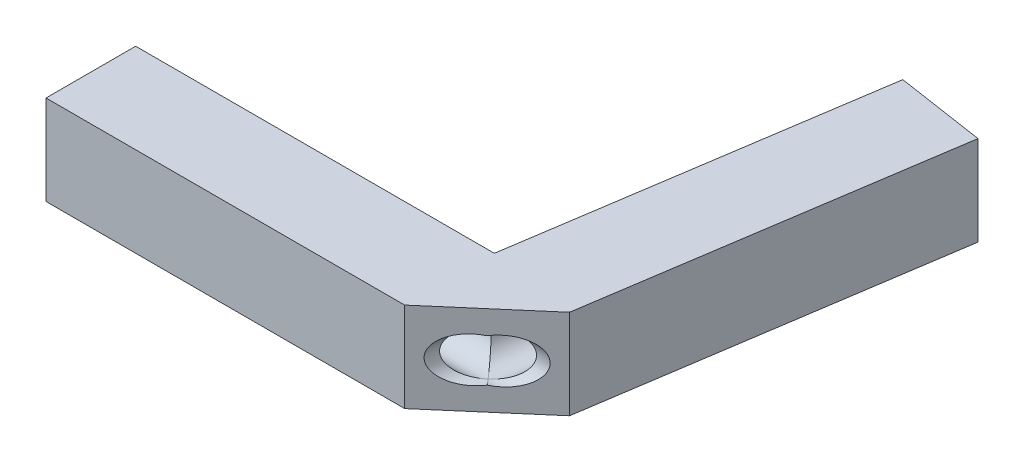
ISO-10303-21;
HEADER;
FILE_DESCRIPTION(('STEP AP214'),'2;1');
FILE_NAME('part.step','',(''),(''),'','','');
FILE_SCHEMA(('AUTOMOTIVE_DESIGN { 1 0 10303 214 1 1 1 1 }'));
ENDSEC;
DATA;
#1=APPLICATION_CONTEXT('core data for automotive mechanical design processes');
#2=APPLICATION_PROTOCOL_DEFINITION('international standard','automotive_design',2000,#1);
#3=PRODUCT_CONTEXT('',#1,'mechanical');
#4=PRODUCT('Part','Part','',(#3));
#5=PRODUCT_RELATED_PRODUCT_CATEGORY('part','',(#4));
#6=PRODUCT_DEFINITION_FORMATION('','',#4);
#7=PRODUCT_DEFINITION_CONTEXT('part definition',#1,'design');
#8=PRODUCT_DEFINITION('design','',#6,#7);
#9=PRODUCT_DEFINITION_SHAPE('','',#8);
#10=(LENGTH_UNIT() NAMED_UNIT(*) SI_UNIT(.MILLI.,.METRE.));
#11=(NAMED_UNIT(*) PLANE_ANGLE_UNIT() SI_UNIT($,.RADIAN.));
#12=(NAMED_UNIT(*) SI_UNIT($,.STERADIAN.) SOLID_ANGLE_UNIT());
#13=UNCERTAINTY_MEASURE_WITH_UNIT(LENGTH_MEASURE(1.E-05),#10,'distance_accuracy_value','');
#14=(GEOMETRIC_REPRESENTATION_CONTEXT(3) GLOBAL_UNCERTAINTY_ASSIGNED_CONTEXT((#13)) GLOBAL_UNIT_ASSIGNED_CONTEXT((#10,
#11,#12)) REPRESENTATION_CONTEXT('',''));
#15=CARTESIAN_POINT('',(0.,0.,0.));
#16=DIRECTION('',(0.,0.,1.));
#17=DIRECTION('',(1.,0.,0.));
#18=AXIS2_PLACEMENT_3D('',#15,#16,#17);
#19=CARTESIAN_POINT('',(4.,1.,1.));
#20=DIRECTION('',(-1.,0.,0.));
#21=DIRECTION('',(0.,0.,1.));
#22=AXIS2_PLACEMENT_3D('',#19,#20,#21);
#23=CYLINDRICAL_SURFACE('',#22,0.5);
#24=CARTESIAN_POINT('',(-8.,1.,1.));
#25=DIRECTION('',(-1.,0.,0.));
#26=DIRECTION('',(0.,0.,1.));
#27=AXIS2_PLACEMENT_3D('',#24,#25,#26);
#28=CIRCLE('',#27,0.5);
#29=CARTESIAN_POINT('',(-8.,1.,1.5));
#30=VERTEX_POINT('',#29);
#31=EDGE_CURVE('E189',#30,#30,#28,.T.);
#32=ORIENTED_EDGE('',*,*,#31,.T.);
#33=EDGE_LOOP('',(#32));
#34=FACE_BOUND('',#33,.T.);
#35=CARTESIAN_POINT('',(0.859680309765816,1.,1.));
#36=DIRECTION('',(-0.758305029177757,0.,0.651899902380512));
#37=DIRECTION('',(-0.651899902380512,0.,-0.758305029177757));
#38=AXIS2_PLACEMENT_3D('',#35,#36,#37);
#39=ELLIPSE('',#38,0.659365269596271,0.5);
#40=CARTESIAN_POINT('',(0.859680309765816,0.5,1.));
#41=VERTEX_POINT('',#40);
#42=CARTESIAN_POINT('',(0.859680309765816,1.5,1.));
#43=VERTEX_POINT('',#42);
#44=EDGE_CURVE('E55',#41,#43,#39,.F.);
#45=ORIENTED_EDGE('',*,*,#44,.T.);
#46=CARTESIAN_POINT('',(0.859680309765816,1.,1.));
#47=DIRECTION('',(-0.651899902380512,0.,-0.758305029177757));
#48=DIRECTION('',(-0.758305029177757,0.,0.651899902380512));
#49=AXIS2_PLACEMENT_3D('',#46,#47,#48);
#50=ELLIPSE('',#49,0.766988916817097,0.5);
#51=EDGE_CURVE('E11',#43,#41,#50,.F.);
#52=ORIENTED_EDGE('',*,*,#51,.T.);
#53=EDGE_LOOP('',(#45,#52));
#54=FACE_BOUND('',#53,.T.);
#55=ADVANCED_FACE('F41',(#34,#54),#23,.F.);
#56=CARTESIAN_POINT('',(1.97735589798252,2.,0.300106069105115));
#57=DIRECTION('',(0.988677948991262,0.,0.150053034552557));
#58=DIRECTION('',(0.150053034552557,0.,-0.988677948991262));
#59=AXIS2_PLACEMENT_3D('',#56,#57,#58);
#60=PLANE('',#59);
#61=DIRECTION('',(-0.150053034552557,0.,0.988677948991262));
#62=VECTOR('',#61,1.);
#63=CARTESIAN_POINT('',(1.97735589798252,0.,0.300106069105115));
#64=LINE('',#63,#62);
#65=CARTESIAN_POINT('',(3.17778017440298,0.,-7.60931752282498));
#66=VERTEX_POINT('',#65);
#67=CARTESIAN_POINT('',(1.97735589798252,0.,0.300106069105114));
#68=VERTEX_POINT('',#67);
#69=EDGE_CURVE('E147',#66,#68,#64,.T.);
#70=ORIENTED_EDGE('',*,*,#69,.F.);
#71=DIRECTION('',(0.,-1.,0.));
#72=VECTOR('',#71,1.);
#73=CARTESIAN_POINT('',(3.17778017440298,2.,-7.60931752282498));
#74=LINE('',#73,#72);
#75=CARTESIAN_POINT('',(3.17778017440298,2.,-7.60931752282498));
#76=VERTEX_POINT('',#75);
#77=EDGE_CURVE('E97',#76,#66,#74,.T.);
#78=ORIENTED_EDGE('',*,*,#77,.F.);
#79=DIRECTION('',(-0.150053034552557,0.,0.988677948991262));
#80=VECTOR('',#79,1.);
#81=CARTESIAN_POINT('',(1.97735589798252,2.,0.300106069105115));
#82=LINE('',#81,#80);
#83=CARTESIAN_POINT('',(1.97735589798252,2.,0.300106069105114));
#84=VERTEX_POINT('',#83);
#85=EDGE_CURVE('E171',#76,#84,#82,.T.);
#86=ORIENTED_EDGE('',*,*,#85,.T.);
#87=DIRECTION('',(0.,-1.,0.));
#88=VECTOR('',#87,1.);
#89=CARTESIAN_POINT('',(1.97735589798252,2.,0.300106069105114));
#90=LINE('',#89,#88);
#91=EDGE_CURVE('E64',#84,#68,#90,.T.);
#92=ORIENTED_EDGE('',*,*,#91,.T.);
#93=EDGE_LOOP('',(#70,#78,#86,#92));
#94=FACE_BOUND('',#93,.T.);
#95=ADVANCED_FACE('F43',(#94),#60,.T.);
#96=CARTESIAN_POINT('',(1.20042427642047,2.,-7.9094235919301));
#97=DIRECTION('',(0.150053034552558,0.,-0.988677948991262));
#98=DIRECTION('',(-0.988677948991262,0.,-0.150053034552558));
#99=AXIS2_PLACEMENT_3D('',#96,#97,#98);
#100=PLANE('',#99);
#101=CARTESIAN_POINT('',(2.18910222541173,1.,-7.75937055737754));
#102=DIRECTION('',(0.150053034552558,0.,-0.988677948991262));
#103=DIRECTION('',(-0.988677948991262,0.,-0.150053034552558));
#104=AXIS2_PLACEMENT_3D('',#101,#102,#103);
#105=CIRCLE('',#104,0.5);
#106=CARTESIAN_POINT('',(1.69476325091609,1.,-7.83439707465382));
#107=VERTEX_POINT('',#106);
#108=EDGE_CURVE('E215',#107,#107,#105,.T.);
#109=ORIENTED_EDGE('',*,*,#108,.F.);
#110=EDGE_LOOP('',(#109));
#111=FACE_BOUND('',#110,.T.);
#112=DIRECTION('',(0.988677948991262,0.,0.150053034552558));
#113=VECTOR('',#112,1.);
#114=CARTESIAN_POINT('',(1.20042427642047,0.,-7.9094235919301));
#115=LINE('',#114,#113);
#116=CARTESIAN_POINT('',(1.20042427642046,0.,-7.9094235919301));
#117=VERTEX_POINT('',#116);
#118=EDGE_CURVE('E150',#117,#66,#115,.T.);
#119=ORIENTED_EDGE('',*,*,#118,.F.);
#120=DIRECTION('',(0.,-1.,0.));
#121=VECTOR('',#120,1.);
#122=CARTESIAN_POINT('',(1.20042427642046,2.,-7.9094235919301));
#123=LINE('',#122,#121);
#124=CARTESIAN_POINT('',(1.20042427642046,2.,-7.9094235919301));
#125=VERTEX_POINT('',#124);
#126=EDGE_CURVE('E181',#125,#117,#123,.T.);
#127=ORIENTED_EDGE('',*,*,#126,.F.);
#128=DIRECTION('',(0.988677948991262,0.,0.150053034552558));
#129=VECTOR('',#128,1.);
#130=CARTESIAN_POINT('',(1.20042427642047,2.,-7.9094235919301));
#131=LINE('',#130,#129);
#132=EDGE_CURVE('E226',#125,#76,#131,.T.);
#133=ORIENTED_EDGE('',*,*,#132,.T.);
#134=ORIENTED_EDGE('',*,*,#77,.T.);
#135=EDGE_LOOP('',(#119,#127,#133,#134));
#136=FACE_BOUND('',#135,.T.);
#137=ADVANCED_FACE('F240',(#111,#136),#100,.T.);
#138=CARTESIAN_POINT('',(0.,2.,0.));
#139=DIRECTION('',(-0.988677948991262,0.,-0.150053034552557));
#140=DIRECTION('',(-0.150053034552557,0.,0.988677948991262));
#141=AXIS2_PLACEMENT_3D('',#138,#139,#140);
#142=PLANE('',#141);
#143=DIRECTION('',(0.150053034552557,0.,-0.988677948991262));
#144=VECTOR('',#143,1.);
#145=CARTESIAN_POINT('',(0.,0.,0.));
#146=LINE('',#145,#144);
#147=CARTESIAN_POINT('',(0.,0.,0.));
#148=VERTEX_POINT('',#147);
#149=EDGE_CURVE('E155',#148,#117,#146,.T.);
#150=ORIENTED_EDGE('',*,*,#149,.F.);
#151=DIRECTION('',(0.,-1.,0.));
#152=VECTOR('',#151,1.);
#153=CARTESIAN_POINT('',(0.,2.,0.));
#154=LINE('',#153,#152);
#155=CARTESIAN_POINT('',(0.,2.,0.));
#156=VERTEX_POINT('',#155);
#157=EDGE_CURVE('E178',#156,#148,#154,.T.);
#158=ORIENTED_EDGE('',*,*,#157,.F.);
#159=DIRECTION('',(0.150053034552557,0.,-0.988677948991262));
#160=VECTOR('',#159,1.);
#161=CARTESIAN_POINT('',(0.,2.,0.));
#162=LINE('',#161,#160);
#163=EDGE_CURVE('E230',#156,#125,#162,.T.);
#164=ORIENTED_EDGE('',*,*,#163,.T.);
#165=ORIENTED_EDGE('',*,*,#126,.T.);
#166=EDGE_LOOP('',(#150,#158,#164,#165));
#167=FACE_BOUND('',#166,.T.);
#168=ADVANCED_FACE('F236',(#167),#142,.T.);
#169=CARTESIAN_POINT('',(0.,2.,0.));
#170=DIRECTION('',(0.,0.,1.));
#171=DIRECTION('',(1.,0.,0.));
#172=AXIS2_PLACEMENT_3D('',#169,#170,#171);
#173=PLANE('',#172);
#174=DIRECTION('',(-1.,0.,0.));
#175=VECTOR('',#174,1.);
#176=CARTESIAN_POINT('',(0.,0.,0.));
#177=LINE('',#176,#175);
#178=CARTESIAN_POINT('',(-8.,0.,0.));
#179=VERTEX_POINT('',#178);
#180=EDGE_CURVE('E159',#148,#179,#177,.T.);
#181=ORIENTED_EDGE('',*,*,#180,.T.);
#182=DIRECTION('',(0.,-1.,0.));
#183=VECTOR('',#182,1.);
#184=CARTESIAN_POINT('',(-8.,2.,0.));
#185=LINE('',#184,#183);
#186=CARTESIAN_POINT('',(-8.,2.,0.));
#187=VERTEX_POINT('',#186);
#188=EDGE_CURVE('E136',#187,#179,#185,.T.);
#189=ORIENTED_EDGE('',*,*,#188,.F.);
#190=DIRECTION('',(-1.,0.,0.));
#191=VECTOR('',#190,1.);
#192=CARTESIAN_POINT('',(0.,2.,0.));
#193=LINE('',#192,#191);
#194=EDGE_CURVE('E121',#156,#187,#193,.T.);
#195=ORIENTED_EDGE('',*,*,#194,.F.);
#196=ORIENTED_EDGE('',*,*,#157,.T.);
#197=EDGE_LOOP('',(#181,#189,#195,#196));
#198=FACE_BOUND('',#197,.T.);
#199=ADVANCED_FACE('F245',(#198),#173,.F.);
#200=CARTESIAN_POINT('',(-8.,2.,0.));
#201=DIRECTION('',(1.,0.,0.));
#202=DIRECTION('',(0.,0.,-1.));
#203=AXIS2_PLACEMENT_3D('',#200,#201,#202);
#204=PLANE('',#203);
#205=ORIENTED_EDGE('',*,*,#31,.F.);
#206=EDGE_LOOP('',(#205));
#207=FACE_BOUND('',#206,.T.);
#208=DIRECTION('',(0.,0.,1.));
#209=VECTOR('',#208,1.);
#210=CARTESIAN_POINT('',(-8.,0.,0.));
#211=LINE('',#210,#209);
#212=CARTESIAN_POINT('',(-8.,0.,2.));
#213=VERTEX_POINT('',#212);
#214=EDGE_CURVE('E131',#179,#213,#211,.T.);
#215=ORIENTED_EDGE('',*,*,#214,.T.);
#216=DIRECTION('',(0.,-1.,0.));
#217=VECTOR('',#216,1.);
#218=CARTESIAN_POINT('',(-8.,2.,2.));
#219=LINE('',#218,#217);
#220=CARTESIAN_POINT('',(-8.,2.,2.));
#221=VERTEX_POINT('',#220);
#222=EDGE_CURVE('E128',#221,#213,#219,.T.);
#223=ORIENTED_EDGE('',*,*,#222,.F.);
#224=DIRECTION('',(0.,0.,1.));
#225=VECTOR('',#224,1.);
#226=CARTESIAN_POINT('',(-8.,2.,0.));
#227=LINE('',#226,#225);
#228=EDGE_CURVE('E113',#187,#221,#227,.T.);
#229=ORIENTED_EDGE('',*,*,#228,.F.);
#230=ORIENTED_EDGE('',*,*,#188,.T.);
#231=EDGE_LOOP('',(#215,#223,#229,#230));
#232=FACE_BOUND('',#231,.T.);
#233=ADVANCED_FACE('F129',(#207,#232),#204,.F.);
#234=CARTESIAN_POINT('',(0.,2.,2.));
#235=DIRECTION('',(0.,0.,1.));
#236=DIRECTION('',(1.,0.,0.));
#237=AXIS2_PLACEMENT_3D('',#234,#235,#236);
#238=PLANE('',#237);
#239=DIRECTION('',(-1.,0.,0.));
#240=VECTOR('',#239,1.);
#241=CARTESIAN_POINT('',(0.,0.,2.));
#242=LINE('',#241,#240);
#243=CARTESIAN_POINT('',(0.,0.,2.));
#244=VERTEX_POINT('',#243);
#245=EDGE_CURVE('E164',#244,#213,#242,.T.);
#246=ORIENTED_EDGE('',*,*,#245,.F.);
#247=DIRECTION('',(0.,-1.,0.));
#248=VECTOR('',#247,1.);
#249=CARTESIAN_POINT('',(0.,2.,2.));
#250=LINE('',#249,#248);
#251=CARTESIAN_POINT('',(0.,2.,2.));
#252=VERTEX_POINT('',#251);
#253=EDGE_CURVE('E137',#252,#244,#250,.T.);
#254=ORIENTED_EDGE('',*,*,#253,.F.);
#255=DIRECTION('',(-1.,0.,0.));
#256=VECTOR('',#255,1.);
#257=CARTESIAN_POINT('',(0.,2.,2.));
#258=LINE('',#257,#256);
#259=EDGE_CURVE('E118',#252,#221,#258,.T.);
#260=ORIENTED_EDGE('',*,*,#259,.T.);
#261=ORIENTED_EDGE('',*,*,#222,.T.);
#262=EDGE_LOOP('',(#246,#254,#260,#261));
#263=FACE_BOUND('',#262,.T.);
#264=ADVANCED_FACE('F139',(#263),#238,.T.);
#265=CARTESIAN_POINT('',(0.988677948991263,2.,1.15005303455256));
#266=DIRECTION('',(0.651899902380513,0.,0.758305029177757));
#267=DIRECTION('',(0.758305029177757,0.,-0.651899902380513));
#268=AXIS2_PLACEMENT_3D('',#265,#266,#267);
#269=PLANE('',#268);
#270=CARTESIAN_POINT('',(0.814132792090512,1.,1.30010606910512));
#271=DIRECTION('',(0.651899902380513,0.,0.758305029177757));
#272=DIRECTION('',(0.758305029177757,0.,-0.651899902380513));
#273=AXIS2_PLACEMENT_3D('',#270,#271,#272);
#274=ELLIPSE('',#273,0.766988916817098,0.5);
#275=CARTESIAN_POINT('',(0.98867794899126,1.4769529188731,1.15005303455256));
#276=VERTEX_POINT('',#275);
#277=CARTESIAN_POINT('',(0.98867794899126,0.523047081126901,1.15005303455256));
#278=VERTEX_POINT('',#277);
#279=EDGE_CURVE('E212',#276,#278,#274,.T.);
#280=ORIENTED_EDGE('',*,*,#279,.F.);
#281=CARTESIAN_POINT('',(1.16322310589201,1.,1.));
#282=DIRECTION('',(0.651899902380513,0.,0.758305029177757));
#283=DIRECTION('',(-0.758305029177757,0.,0.651899902380513));
#284=AXIS2_PLACEMENT_3D('',#281,#282,#283);
#285=ELLIPSE('',#284,0.766988916817096,0.5);
#286=EDGE_CURVE('E151',#278,#276,#285,.T.);
#287=ORIENTED_EDGE('',*,*,#286,.F.);
#288=EDGE_LOOP('',(#280,#287));
#289=FACE_BOUND('',#288,.T.);
#290=DIRECTION('',(-0.758305029177757,0.,0.651899902380512));
#291=VECTOR('',#290,1.);
#292=CARTESIAN_POINT('',(0.988677948991263,0.,1.15005303455256));
#293=LINE('',#292,#291);
#294=EDGE_CURVE('E167',#68,#244,#293,.T.);
#295=ORIENTED_EDGE('',*,*,#294,.F.);
#296=ORIENTED_EDGE('',*,*,#91,.F.);
#297=DIRECTION('',(-0.758305029177757,0.,0.651899902380512));
#298=VECTOR('',#297,1.);
#299=CARTESIAN_POINT('',(0.988677948991263,2.,1.15005303455256));
#300=LINE('',#299,#298);
#301=EDGE_CURVE('E141',#84,#252,#300,.T.);
#302=ORIENTED_EDGE('',*,*,#301,.T.);
#303=ORIENTED_EDGE('',*,*,#253,.T.);
#304=EDGE_LOOP('',(#295,#296,#302,#303));
#305=FACE_BOUND('',#304,.T.);
#306=ADVANCED_FACE('F211',(#289,#305),#269,.T.);
#307=CARTESIAN_POINT('',(0.,2.,0.));
#308=DIRECTION('',(0.,1.,0.));
#309=DIRECTION('',(0.,0.,1.));
#310=AXIS2_PLACEMENT_3D('',#307,#308,#309);
#311=PLANE('',#310);
#312=ORIENTED_EDGE('',*,*,#85,.F.);
#313=ORIENTED_EDGE('',*,*,#132,.F.);
#314=ORIENTED_EDGE('',*,*,#163,.F.);
#315=ORIENTED_EDGE('',*,*,#194,.T.);
#316=ORIENTED_EDGE('',*,*,#228,.T.);
#317=ORIENTED_EDGE('',*,*,#259,.F.);
#318=ORIENTED_EDGE('',*,*,#301,.F.);
#319=EDGE_LOOP('',(#312,#313,#314,#315,#316,#317,#318));
#320=FACE_BOUND('',#319,.T.);
#321=ADVANCED_FACE('F115',(#320),#311,.T.);
#322=CARTESIAN_POINT('',(0.,0.,0.));
#323=DIRECTION('',(0.,1.,0.));
#324=DIRECTION('',(0.,0.,1.));
#325=AXIS2_PLACEMENT_3D('',#322,#323,#324);
#326=PLANE('',#325);
#327=ORIENTED_EDGE('',*,*,#69,.T.);
#328=ORIENTED_EDGE('',*,*,#294,.T.);
#329=ORIENTED_EDGE('',*,*,#245,.T.);
#330=ORIENTED_EDGE('',*,*,#214,.F.);
#331=ORIENTED_EDGE('',*,*,#180,.F.);
#332=ORIENTED_EDGE('',*,*,#149,.T.);
#333=ORIENTED_EDGE('',*,*,#118,.T.);
#334=EDGE_LOOP('',(#327,#328,#329,#330,#331,#332,#333));
#335=FACE_BOUND('',#334,.T.);
#336=ADVANCED_FACE('F243',(#335),#326,.F.);
#337=CARTESIAN_POINT('',(0.859680309765816,1.,1.));
#338=DIRECTION('',(-0.758305029177757,0.,0.651899902380512));
#339=DIRECTION('',(-0.651899902380512,0.,-0.758305029177757));
#340=AXIS2_PLACEMENT_3D('',#337,#338,#339);
#341=ELLIPSE('',#340,0.659365269596271,0.5);
#342=EDGE_CURVE('E192',#276,#43,#341,.T.);
#343=ORIENTED_EDGE('',*,*,#342,.T.);
#344=CARTESIAN_POINT('',(0.859680309765816,1.,1.));
#345=DIRECTION('',(-0.651899902380512,0.,-0.758305029177757));
#346=DIRECTION('',(-0.758305029177757,0.,0.651899902380512));
#347=AXIS2_PLACEMENT_3D('',#344,#345,#346);
#348=ELLIPSE('',#347,0.766988916817097,0.5);
#349=EDGE_CURVE('E50',#43,#41,#348,.T.);
#350=ORIENTED_EDGE('',*,*,#349,.T.);
#351=EDGE_CURVE('E195',#41,#278,#341,.T.);
#352=ORIENTED_EDGE('',*,*,#351,.T.);
#353=ORIENTED_EDGE('',*,*,#286,.T.);
#354=EDGE_LOOP('',(#343,#350,#352,#353));
#355=FACE_BOUND('',#354,.T.);
#356=ADVANCED_FACE('F204',(#355),#23,.F.);
#357=CARTESIAN_POINT('',(0.388465810781028,1.,4.1047648305176));
#358=DIRECTION('',(0.150053034552558,0.,-0.988677948991262));
#359=DIRECTION('',(-0.988677948991262,0.,-0.150053034552558));
#360=AXIS2_PLACEMENT_3D('',#357,#358,#359);
#361=CYLINDRICAL_SURFACE('',#360,0.5);
#362=ORIENTED_EDGE('',*,*,#108,.T.);
#363=EDGE_LOOP('',(#362));
#364=FACE_BOUND('',#363,.T.);
#365=ORIENTED_EDGE('',*,*,#44,.F.);
#366=ORIENTED_EDGE('',*,*,#349,.F.);
#367=EDGE_LOOP('',(#365,#366));
#368=FACE_BOUND('',#367,.T.);
#369=ADVANCED_FACE('F264',(#364,#368),#361,.F.);
#370=ORIENTED_EDGE('',*,*,#342,.F.);
#371=ORIENTED_EDGE('',*,*,#279,.T.);
#372=ORIENTED_EDGE('',*,*,#351,.F.);
#373=ORIENTED_EDGE('',*,*,#51,.F.);
#374=EDGE_LOOP('',(#370,#371,#372,#373));
#375=FACE_BOUND('',#374,.T.);
#376=ADVANCED_FACE('F269',(#375),#361,.F.);
#377=CLOSED_SHELL('',(#55,#95,#137,#168,#199,#233,#264,#306,#321,#336,#356,#369,#376));
#378=MANIFOLD_SOLID_BREP('B2',#377);
#379=ADVANCED_BREP_SHAPE_REPRESENTATION('',(#18,#378),#14);
#380=SHAPE_DEFINITION_REPRESENTATION(#9,#379);
ENDSEC;
END-ISO-10303-21;
